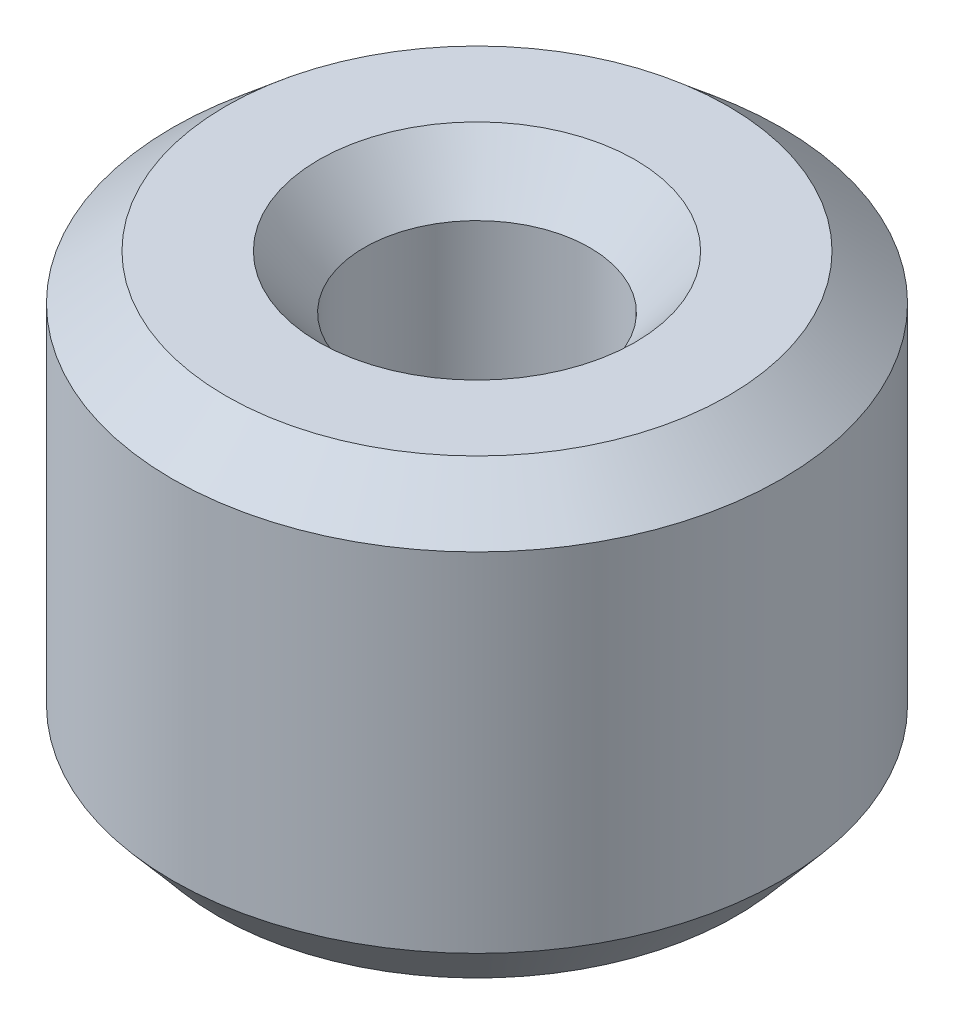
ISO-10303-21;
HEADER;
FILE_DESCRIPTION(('STEP AP214'),'2;1');
FILE_NAME('part.step','',(''),(''),'','','');
FILE_SCHEMA(('AUTOMOTIVE_DESIGN { 1 0 10303 214 1 1 1 1 }'));
ENDSEC;
DATA;
#1=APPLICATION_CONTEXT('core data for automotive mechanical design processes');
#2=APPLICATION_PROTOCOL_DEFINITION('international standard','automotive_design',2000,#1);
#3=PRODUCT_CONTEXT('',#1,'mechanical');
#4=PRODUCT('Part','Part','',(#3));
#5=PRODUCT_RELATED_PRODUCT_CATEGORY('part','',(#4));
#6=PRODUCT_DEFINITION_FORMATION('','',#4);
#7=PRODUCT_DEFINITION_CONTEXT('part definition',#1,'design');
#8=PRODUCT_DEFINITION('design','',#6,#7);
#9=PRODUCT_DEFINITION_SHAPE('','',#8);
#10=(LENGTH_UNIT() NAMED_UNIT(*) SI_UNIT(.MILLI.,.METRE.));
#11=(NAMED_UNIT(*) PLANE_ANGLE_UNIT() SI_UNIT($,.RADIAN.));
#12=(NAMED_UNIT(*) SI_UNIT($,.STERADIAN.) SOLID_ANGLE_UNIT());
#13=UNCERTAINTY_MEASURE_WITH_UNIT(LENGTH_MEASURE(1.E-05),#10,'distance_accuracy_value','');
#14=(GEOMETRIC_REPRESENTATION_CONTEXT(3) GLOBAL_UNCERTAINTY_ASSIGNED_CONTEXT((#13)) GLOBAL_UNIT_ASSIGNED_CONTEXT((#10,
#11,#12)) REPRESENTATION_CONTEXT('',''));
#15=CARTESIAN_POINT('',(0.,0.,0.));
#16=DIRECTION('',(0.,0.,1.));
#17=DIRECTION('',(1.,0.,0.));
#18=AXIS2_PLACEMENT_3D('',#15,#16,#17);
#19=CARTESIAN_POINT('',(0.,18.3282113967099,0.));
#20=DIRECTION('',(0.,-1.,0.));
#21=DIRECTION('',(0.,0.,-1.));
#22=AXIS2_PLACEMENT_3D('',#19,#20,#21);
#23=CYLINDRICAL_SURFACE('',#22,12.5);
#24=CARTESIAN_POINT('',(0.,2.19213421698587,0.));
#25=DIRECTION('',(0.,1.,0.));
#26=DIRECTION('',(0.,0.,1.));
#27=AXIS2_PLACEMENT_3D('',#24,#25,#26);
#28=CIRCLE('',#27,12.5);
#29=CARTESIAN_POINT('',(0.,2.19213421698587,12.5));
#30=VERTEX_POINT('',#29);
#31=EDGE_CURVE('E10',#30,#30,#28,.T.);
#32=ORIENTED_EDGE('',*,*,#31,.T.);
#33=EDGE_LOOP('',(#32));
#34=FACE_BOUND('',#33,.T.);
#35=CARTESIAN_POINT('',(0.,16.465658353767,0.));
#36=DIRECTION('',(0.,1.,0.));
#37=DIRECTION('',(0.,0.,1.));
#38=AXIS2_PLACEMENT_3D('',#35,#36,#37);
#39=CIRCLE('',#38,12.5);
#40=CARTESIAN_POINT('',(0.,16.465658353767,12.5));
#41=VERTEX_POINT('',#40);
#42=EDGE_CURVE('E50',#41,#41,#39,.F.);
#43=ORIENTED_EDGE('',*,*,#42,.T.);
#44=EDGE_LOOP('',(#43));
#45=FACE_BOUND('',#44,.T.);
#46=ADVANCED_FACE('F39',(#34,#45),#23,.T.);
#47=CARTESIAN_POINT('',(0.,18.3282113967099,0.));
#48=DIRECTION('',(0.,1.,0.));
#49=DIRECTION('',(0.,0.,1.));
#50=AXIS2_PLACEMENT_3D('',#47,#48,#49);
#51=PLANE('',#50);
#52=CARTESIAN_POINT('',(0.,18.3282113967099,0.));
#53=DIRECTION('',(0.,1.,0.));
#54=DIRECTION('',(0.,0.,1.));
#55=AXIS2_PLACEMENT_3D('',#52,#53,#54);
#56=CIRCLE('',#55,6.49236846888358);
#57=CARTESIAN_POINT('',(0.,18.3282113967099,6.49236846888358));
#58=VERTEX_POINT('',#57);
#59=EDGE_CURVE('E58',#58,#58,#56,.F.);
#60=ORIENTED_EDGE('',*,*,#59,.T.);
#61=EDGE_LOOP('',(#60));
#62=FACE_BOUND('',#61,.T.);
#63=CARTESIAN_POINT('',(0.,18.3282113967099,0.));
#64=DIRECTION('',(0.,1.,0.));
#65=DIRECTION('',(0.,0.,1.));
#66=AXIS2_PLACEMENT_3D('',#63,#64,#65);
#67=CIRCLE('',#66,10.3078657830141);
#68=CARTESIAN_POINT('',(0.,18.3282113967099,10.3078657830141));
#69=VERTEX_POINT('',#68);
#70=EDGE_CURVE('E61',#69,#69,#67,.T.);
#71=ORIENTED_EDGE('',*,*,#70,.T.);
#72=EDGE_LOOP('',(#71));
#73=FACE_BOUND('',#72,.T.);
#74=ADVANCED_FACE('F88',(#62,#73),#51,.T.);
#75=CARTESIAN_POINT('',(0.,0.,0.));
#76=DIRECTION('',(0.,1.,0.));
#77=DIRECTION('',(0.,0.,1.));
#78=AXIS2_PLACEMENT_3D('',#75,#76,#77);
#79=PLANE('',#78);
#80=CARTESIAN_POINT('',(0.,0.,0.));
#81=DIRECTION('',(0.,1.,0.));
#82=DIRECTION('',(0.,0.,1.));
#83=AXIS2_PLACEMENT_3D('',#80,#81,#82);
#84=CIRCLE('',#83,6.82194964292663);
#85=CARTESIAN_POINT('',(0.,0.,6.82194964292663));
#86=VERTEX_POINT('',#85);
#87=EDGE_CURVE('E51',#86,#86,#84,.T.);
#88=ORIENTED_EDGE('',*,*,#87,.T.);
#89=EDGE_LOOP('',(#88));
#90=FACE_BOUND('',#89,.T.);
#91=CARTESIAN_POINT('',(0.,0.,0.));
#92=DIRECTION('',(0.,1.,0.));
#93=DIRECTION('',(0.,0.,1.));
#94=AXIS2_PLACEMENT_3D('',#91,#92,#93);
#95=CIRCLE('',#94,10.6374469570572);
#96=CARTESIAN_POINT('',(0.,0.,10.6374469570572));
#97=VERTEX_POINT('',#96);
#98=EDGE_CURVE('E54',#97,#97,#95,.F.);
#99=ORIENTED_EDGE('',*,*,#98,.T.);
#100=EDGE_LOOP('',(#99));
#101=FACE_BOUND('',#100,.T.);
#102=ADVANCED_FACE('F83',(#90,#101),#79,.F.);
#103=CARTESIAN_POINT('',(0.,18.3282113967099,0.));
#104=DIRECTION('',(0.,-1.,0.));
#105=DIRECTION('',(0.,0.,-1.));
#106=AXIS2_PLACEMENT_3D('',#103,#104,#105);
#107=CYLINDRICAL_SURFACE('',#106,4.62981542594076);
#108=CARTESIAN_POINT('',(0.,16.136077179724,0.));
#109=DIRECTION('',(0.,1.,0.));
#110=DIRECTION('',(0.,0.,1.));
#111=AXIS2_PLACEMENT_3D('',#108,#109,#110);
#112=CIRCLE('',#111,4.62981542594076);
#113=CARTESIAN_POINT('',(0.,16.136077179724,4.62981542594076));
#114=VERTEX_POINT('',#113);
#115=EDGE_CURVE('E67',#114,#114,#112,.T.);
#116=ORIENTED_EDGE('',*,*,#115,.T.);
#117=EDGE_LOOP('',(#116));
#118=FACE_BOUND('',#117,.T.);
#119=CARTESIAN_POINT('',(0.,1.86255304294282,0.));
#120=DIRECTION('',(0.,1.,0.));
#121=DIRECTION('',(0.,0.,1.));
#122=AXIS2_PLACEMENT_3D('',#119,#120,#121);
#123=CIRCLE('',#122,4.62981542594076);
#124=CARTESIAN_POINT('',(0.,1.86255304294282,4.62981542594076));
#125=VERTEX_POINT('',#124);
#126=EDGE_CURVE('E69',#125,#125,#123,.F.);
#127=ORIENTED_EDGE('',*,*,#126,.T.);
#128=EDGE_LOOP('',(#127));
#129=FACE_BOUND('',#128,.T.);
#130=ADVANCED_FACE('F71',(#118,#129),#107,.F.);
#131=CARTESIAN_POINT('',(0.,16.136077179724,0.));
#132=DIRECTION('',(0.,1.,0.));
#133=DIRECTION('',(0.,0.,1.));
#134=AXIS2_PLACEMENT_3D('',#131,#132,#133);
#135=CONICAL_SURFACE('',#134,4.62981542594076,0.704292480098613);
#136=ORIENTED_EDGE('',*,*,#59,.F.);
#137=EDGE_LOOP('',(#136));
#138=FACE_BOUND('',#137,.T.);
#139=ORIENTED_EDGE('',*,*,#115,.F.);
#140=EDGE_LOOP('',(#139));
#141=FACE_BOUND('',#140,.T.);
#142=ADVANCED_FACE('F77',(#138,#141),#135,.F.);
#143=CARTESIAN_POINT('',(0.,0.,0.));
#144=DIRECTION('',(0.,-1.,0.));
#145=DIRECTION('',(0.,0.,-1.));
#146=AXIS2_PLACEMENT_3D('',#143,#144,#145);
#147=CONICAL_SURFACE('',#146,6.82194964292663,0.866503846696284);
#148=ORIENTED_EDGE('',*,*,#126,.F.);
#149=EDGE_LOOP('',(#148));
#150=FACE_BOUND('',#149,.T.);
#151=ORIENTED_EDGE('',*,*,#87,.F.);
#152=EDGE_LOOP('',(#151));
#153=FACE_BOUND('',#152,.T.);
#154=ADVANCED_FACE('F73',(#150,#153),#147,.F.);
#155=CARTESIAN_POINT('',(0.,2.19213421698587,0.));
#156=DIRECTION('',(0.,1.,0.));
#157=DIRECTION('',(0.,0.,1.));
#158=AXIS2_PLACEMENT_3D('',#155,#156,#157);
#159=CONICAL_SURFACE('',#158,12.5,0.704292480098612);
#160=ORIENTED_EDGE('',*,*,#98,.F.);
#161=EDGE_LOOP('',(#160));
#162=FACE_BOUND('',#161,.T.);
#163=ORIENTED_EDGE('',*,*,#31,.F.);
#164=EDGE_LOOP('',(#163));
#165=FACE_BOUND('',#164,.T.);
#166=ADVANCED_FACE('F76',(#162,#165),#159,.T.);
#167=CARTESIAN_POINT('',(0.,18.3282113967099,0.));
#168=DIRECTION('',(0.,-1.,0.));
#169=DIRECTION('',(0.,0.,-1.));
#170=AXIS2_PLACEMENT_3D('',#167,#168,#169);
#171=CONICAL_SURFACE('',#170,10.3078657830141,0.866503846696283);
#172=ORIENTED_EDGE('',*,*,#42,.F.);
#173=EDGE_LOOP('',(#172));
#174=FACE_BOUND('',#173,.T.);
#175=ORIENTED_EDGE('',*,*,#70,.F.);
#176=EDGE_LOOP('',(#175));
#177=FACE_BOUND('',#176,.T.);
#178=ADVANCED_FACE('F45',(#174,#177),#171,.T.);
#179=CLOSED_SHELL('',(#46,#74,#102,#130,#142,#154,#166,#178));
#180=MANIFOLD_SOLID_BREP('B2',#179);
#181=ADVANCED_BREP_SHAPE_REPRESENTATION('',(#18,#180),#14);
#182=SHAPE_DEFINITION_REPRESENTATION(#9,#181);
ENDSEC;
END-ISO-10303-21;
